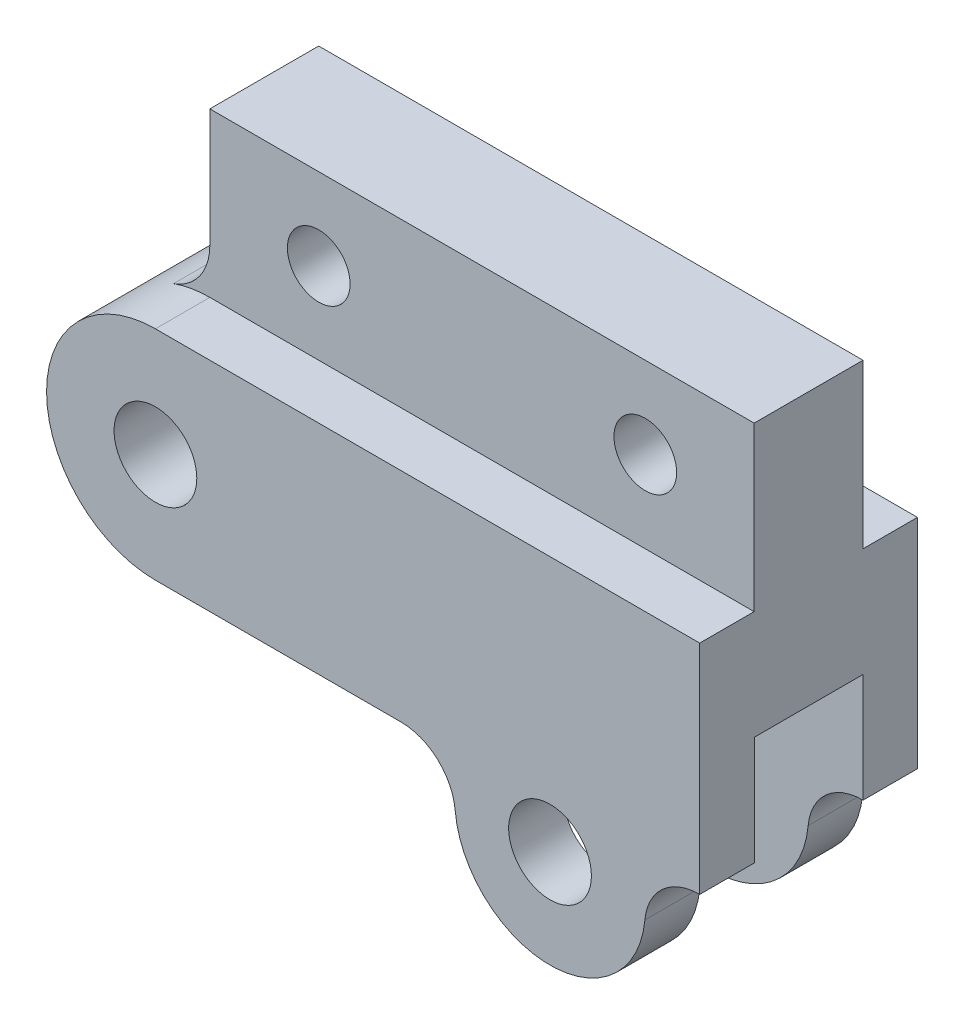
ISO-10303-21;
HEADER;
FILE_DESCRIPTION(('STEP AP214'),'2;1');
FILE_NAME('part.step','',(''),(''),'','','');
FILE_SCHEMA(('AUTOMOTIVE_DESIGN { 1 0 10303 214 1 1 1 1 }'));
ENDSEC;
DATA;
#1=APPLICATION_CONTEXT('core data for automotive mechanical design processes');
#2=APPLICATION_PROTOCOL_DEFINITION('international standard','automotive_design',2000,#1);
#3=PRODUCT_CONTEXT('',#1,'mechanical');
#4=PRODUCT('Part','Part','',(#3));
#5=PRODUCT_RELATED_PRODUCT_CATEGORY('part','',(#4));
#6=PRODUCT_DEFINITION_FORMATION('','',#4);
#7=PRODUCT_DEFINITION_CONTEXT('part definition',#1,'design');
#8=PRODUCT_DEFINITION('design','',#6,#7);
#9=PRODUCT_DEFINITION_SHAPE('','',#8);
#10=(LENGTH_UNIT() NAMED_UNIT(*) SI_UNIT(.MILLI.,.METRE.));
#11=(NAMED_UNIT(*) PLANE_ANGLE_UNIT() SI_UNIT($,.RADIAN.));
#12=(NAMED_UNIT(*) SI_UNIT($,.STERADIAN.) SOLID_ANGLE_UNIT());
#13=UNCERTAINTY_MEASURE_WITH_UNIT(LENGTH_MEASURE(1.E-05),#10,'distance_accuracy_value','');
#14=(GEOMETRIC_REPRESENTATION_CONTEXT(3) GLOBAL_UNCERTAINTY_ASSIGNED_CONTEXT((#13)) GLOBAL_UNIT_ASSIGNED_CONTEXT((#10,
#11,#12)) REPRESENTATION_CONTEXT('',''));
#15=CARTESIAN_POINT('',(0.,0.,0.));
#16=DIRECTION('',(0.,0.,1.));
#17=DIRECTION('',(1.,0.,0.));
#18=AXIS2_PLACEMENT_3D('',#15,#16,#17);
#19=CARTESIAN_POINT('',(-12.7,0.,-6.35));
#20=DIRECTION('',(0.,0.,-1.));
#21=DIRECTION('',(-1.,0.,0.));
#22=AXIS2_PLACEMENT_3D('',#19,#20,#21);
#23=CYLINDRICAL_SURFACE('',#22,6.35);
#24=DIRECTION('',(0.,0.,-1.));
#25=VECTOR('',#24,1.);
#26=CARTESIAN_POINT('',(-14.8166666666667,5.9868374140461,-6.35));
#27=LINE('',#26,#25);
#28=CARTESIAN_POINT('',(-14.8166666666667,5.9868374140461,3.175));
#29=VERTEX_POINT('',#28);
#30=CARTESIAN_POINT('',(-14.8166666666667,5.9868374140461,-3.175));
#31=VERTEX_POINT('',#30);
#32=EDGE_CURVE('E351',#29,#31,#27,.T.);
#33=ORIENTED_EDGE('',*,*,#32,.T.);
#34=CARTESIAN_POINT('',(-12.7,0.,-3.175));
#35=DIRECTION('',(0.,0.,1.));
#36=DIRECTION('',(1.,0.,0.));
#37=AXIS2_PLACEMENT_3D('',#34,#35,#36);
#38=CIRCLE('',#37,6.35);
#39=CARTESIAN_POINT('',(-12.7,6.35,-3.175));
#40=VERTEX_POINT('',#39);
#41=EDGE_CURVE('E354',#31,#40,#38,.F.);
#42=ORIENTED_EDGE('',*,*,#41,.T.);
#43=DIRECTION('',(0.,0.,-1.));
#44=VECTOR('',#43,1.);
#45=CARTESIAN_POINT('',(-12.7,6.35,6.35));
#46=LINE('',#45,#44);
#47=CARTESIAN_POINT('',(-12.7,6.35,-6.35));
#48=VERTEX_POINT('',#47);
#49=EDGE_CURVE('E340',#48,#40,#46,.F.);
#50=ORIENTED_EDGE('',*,*,#49,.F.);
#51=CARTESIAN_POINT('',(-12.7,0.,-6.35));
#52=DIRECTION('',(0.,0.,1.));
#53=DIRECTION('',(1.,0.,0.));
#54=AXIS2_PLACEMENT_3D('',#51,#52,#53);
#55=CIRCLE('',#54,6.35);
#56=CARTESIAN_POINT('',(-12.7,-6.35,-6.35));
#57=VERTEX_POINT('',#56);
#58=EDGE_CURVE('E346',#57,#48,#55,.F.);
#59=ORIENTED_EDGE('',*,*,#58,.F.);
#60=DIRECTION('',(0.,0.,1.));
#61=VECTOR('',#60,1.);
#62=CARTESIAN_POINT('',(-12.7,-6.35,-6.35));
#63=LINE('',#62,#61);
#64=CARTESIAN_POINT('',(-12.7,-6.35,6.35));
#65=VERTEX_POINT('',#64);
#66=EDGE_CURVE('E343',#65,#57,#63,.F.);
#67=ORIENTED_EDGE('',*,*,#66,.F.);
#68=CARTESIAN_POINT('',(-12.7,0.,6.35));
#69=DIRECTION('',(0.,0.,1.));
#70=DIRECTION('',(1.,0.,0.));
#71=AXIS2_PLACEMENT_3D('',#68,#69,#70);
#72=CIRCLE('',#71,6.35);
#73=CARTESIAN_POINT('',(-12.7,6.35,6.35));
#74=VERTEX_POINT('',#73);
#75=EDGE_CURVE('E348',#74,#65,#72,.T.);
#76=ORIENTED_EDGE('',*,*,#75,.F.);
#77=DIRECTION('',(0.,0.,-1.));
#78=VECTOR('',#77,1.);
#79=CARTESIAN_POINT('',(-12.7,6.35,6.35));
#80=LINE('',#79,#78);
#81=CARTESIAN_POINT('',(-12.7,6.35,3.175));
#82=VERTEX_POINT('',#81);
#83=EDGE_CURVE('E337',#82,#74,#80,.F.);
#84=ORIENTED_EDGE('',*,*,#83,.F.);
#85=CARTESIAN_POINT('',(-12.7,0.,3.175));
#86=DIRECTION('',(0.,0.,1.));
#87=DIRECTION('',(1.,0.,0.));
#88=AXIS2_PLACEMENT_3D('',#85,#86,#87);
#89=CIRCLE('',#88,6.35);
#90=EDGE_CURVE('E50',#82,#29,#89,.T.);
#91=ORIENTED_EDGE('',*,*,#90,.T.);
#92=EDGE_LOOP('',(#33,#42,#50,#59,#67,#76,#84,#91));
#93=FACE_BOUND('',#92,.T.);
#94=ADVANCED_FACE('F36',(#93),#23,.T.);
#95=CARTESIAN_POINT('',(0.,6.35,6.35));
#96=DIRECTION('',(0.,-1.,0.));
#97=DIRECTION('',(0.,0.,-1.));
#98=AXIS2_PLACEMENT_3D('',#95,#96,#97);
#99=PLANE('',#98);
#100=DIRECTION('',(-1.,0.,0.));
#101=VECTOR('',#100,1.);
#102=CARTESIAN_POINT('',(0.,6.35,-6.35));
#103=LINE('',#102,#101);
#104=CARTESIAN_POINT('',(19.05,6.35,-6.35));
#105=VERTEX_POINT('',#104);
#106=EDGE_CURVE('E408',#105,#48,#103,.T.);
#107=ORIENTED_EDGE('',*,*,#106,.T.);
#108=ORIENTED_EDGE('',*,*,#49,.T.);
#109=DIRECTION('',(1.,0.,0.));
#110=VECTOR('',#109,1.);
#111=CARTESIAN_POINT('',(19.05,6.35,-3.175));
#112=LINE('',#111,#110);
#113=CARTESIAN_POINT('',(19.05,6.35,-3.175));
#114=VERTEX_POINT('',#113);
#115=EDGE_CURVE('E265',#40,#114,#112,.T.);
#116=ORIENTED_EDGE('',*,*,#115,.T.);
#117=DIRECTION('',(0.,0.,-1.));
#118=VECTOR('',#117,1.);
#119=CARTESIAN_POINT('',(19.05,6.35,6.35));
#120=LINE('',#119,#118);
#121=EDGE_CURVE('E384',#114,#105,#120,.T.);
#122=ORIENTED_EDGE('',*,*,#121,.T.);
#123=EDGE_LOOP('',(#107,#108,#116,#122));
#124=FACE_BOUND('',#123,.T.);
#125=ADVANCED_FACE('F450',(#124),#99,.F.);
#126=CARTESIAN_POINT('',(10.31875,-8.73125,-6.35));
#127=DIRECTION('',(0.,0.,-1.));
#128=DIRECTION('',(-1.,0.,0.));
#129=AXIS2_PLACEMENT_3D('',#126,#127,#128);
#130=CYLINDRICAL_SURFACE('',#129,5.55625);
#131=CARTESIAN_POINT('',(10.31875,-8.73125,-3.175));
#132=DIRECTION('',(0.,0.,1.));
#133=DIRECTION('',(1.,0.,0.));
#134=AXIS2_PLACEMENT_3D('',#131,#132,#133);
#135=CIRCLE('',#134,5.55625);
#136=CARTESIAN_POINT('',(4.7855073452035,-9.23636363636363,-3.175));
#137=VERTEX_POINT('',#136);
#138=CARTESIAN_POINT('',(15.8519926547965,-9.23636363636363,-3.175));
#139=VERTEX_POINT('',#138);
#140=EDGE_CURVE('E298',#137,#139,#135,.T.);
#141=ORIENTED_EDGE('',*,*,#140,.F.);
#142=DIRECTION('',(0.,0.,-1.));
#143=VECTOR('',#142,1.);
#144=CARTESIAN_POINT('',(4.7855073452035,-9.23636363636363,-6.35));
#145=LINE('',#144,#143);
#146=CARTESIAN_POINT('',(4.7855073452035,-9.23636363636363,-6.35));
#147=VERTEX_POINT('',#146);
#148=EDGE_CURVE('E312',#137,#147,#145,.T.);
#149=ORIENTED_EDGE('',*,*,#148,.T.);
#150=CARTESIAN_POINT('',(10.31875,-8.73125,-6.35));
#151=DIRECTION('',(0.,0.,1.));
#152=DIRECTION('',(1.,0.,0.));
#153=AXIS2_PLACEMENT_3D('',#150,#151,#152);
#154=CIRCLE('',#153,5.55625);
#155=CARTESIAN_POINT('',(15.8519926547965,-9.23636363636363,-6.35));
#156=VERTEX_POINT('',#155);
#157=EDGE_CURVE('E295',#156,#147,#154,.F.);
#158=ORIENTED_EDGE('',*,*,#157,.F.);
#159=DIRECTION('',(0.,0.,-1.));
#160=VECTOR('',#159,1.);
#161=CARTESIAN_POINT('',(15.8519926547965,-9.23636363636363,-6.35));
#162=LINE('',#161,#160);
#163=EDGE_CURVE('E310',#156,#139,#162,.F.);
#164=ORIENTED_EDGE('',*,*,#163,.T.);
#165=EDGE_LOOP('',(#141,#149,#158,#164));
#166=FACE_BOUND('',#165,.T.);
#167=ADVANCED_FACE('F462',(#166),#130,.T.);
#168=CARTESIAN_POINT('',(10.31875,-8.73125,3.1496));
#169=DIRECTION('',(0.,0.,-1.));
#170=DIRECTION('',(-1.,0.,0.));
#171=AXIS2_PLACEMENT_3D('',#168,#169,#170);
#172=CYLINDRICAL_SURFACE('',#171,5.55625);
#173=CARTESIAN_POINT('',(10.31875,-8.73125,6.35));
#174=DIRECTION('',(0.,0.,1.));
#175=DIRECTION('',(1.,0.,0.));
#176=AXIS2_PLACEMENT_3D('',#173,#174,#175);
#177=CIRCLE('',#176,5.55625);
#178=CARTESIAN_POINT('',(4.7855073452035,-9.23636363636363,6.35));
#179=VERTEX_POINT('',#178);
#180=CARTESIAN_POINT('',(15.8519926547965,-9.23636363636363,6.35));
#181=VERTEX_POINT('',#180);
#182=EDGE_CURVE('E292',#179,#181,#177,.T.);
#183=ORIENTED_EDGE('',*,*,#182,.F.);
#184=DIRECTION('',(0.,0.,-1.));
#185=VECTOR('',#184,1.);
#186=CARTESIAN_POINT('',(4.7855073452035,-9.23636363636363,3.1496));
#187=LINE('',#186,#185);
#188=CARTESIAN_POINT('',(4.7855073452035,-9.23636363636363,3.1496));
#189=VERTEX_POINT('',#188);
#190=EDGE_CURVE('E303',#179,#189,#187,.T.);
#191=ORIENTED_EDGE('',*,*,#190,.T.);
#192=CARTESIAN_POINT('',(10.31875,-8.73125,3.1496));
#193=DIRECTION('',(0.,0.,1.));
#194=DIRECTION('',(1.,0.,0.));
#195=AXIS2_PLACEMENT_3D('',#192,#193,#194);
#196=CIRCLE('',#195,5.55625);
#197=CARTESIAN_POINT('',(15.8519926547965,-9.23636363636363,3.1496));
#198=VERTEX_POINT('',#197);
#199=EDGE_CURVE('E289',#198,#189,#196,.F.);
#200=ORIENTED_EDGE('',*,*,#199,.F.);
#201=DIRECTION('',(0.,0.,-1.));
#202=VECTOR('',#201,1.);
#203=CARTESIAN_POINT('',(15.8519926547965,-9.23636363636363,3.1496));
#204=LINE('',#203,#202);
#205=EDGE_CURVE('E301',#198,#181,#204,.F.);
#206=ORIENTED_EDGE('',*,*,#205,.T.);
#207=EDGE_LOOP('',(#183,#191,#200,#206));
#208=FACE_BOUND('',#207,.T.);
#209=ADVANCED_FACE('F432',(#208),#172,.T.);
#210=CARTESIAN_POINT('',(0.,-6.35,6.35));
#211=DIRECTION('',(0.,-1.,0.));
#212=DIRECTION('',(0.,0.,-1.));
#213=AXIS2_PLACEMENT_3D('',#210,#211,#212);
#214=PLANE('',#213);
#215=DIRECTION('',(-1.,0.,0.));
#216=VECTOR('',#215,1.);
#217=CARTESIAN_POINT('',(0.,-6.35,-3.175));
#218=LINE('',#217,#216);
#219=CARTESIAN_POINT('',(19.05,-6.35,-3.175));
#220=VERTEX_POINT('',#219);
#221=CARTESIAN_POINT('',(19.0138456003945,-6.35,-3.175));
#222=VERTEX_POINT('',#221);
#223=EDGE_CURVE('E229',#220,#222,#218,.T.);
#224=ORIENTED_EDGE('',*,*,#223,.T.);
#225=DIRECTION('',(0.,0.,1.));
#226=VECTOR('',#225,1.);
#227=CARTESIAN_POINT('',(19.0138456003945,-6.35,-6.35));
#228=LINE('',#227,#226);
#229=CARTESIAN_POINT('',(19.0138456003945,-6.35,-6.35));
#230=VERTEX_POINT('',#229);
#231=EDGE_CURVE('E318',#222,#230,#228,.F.);
#232=ORIENTED_EDGE('',*,*,#231,.T.);
#233=DIRECTION('',(-1.,0.,0.));
#234=VECTOR('',#233,1.);
#235=CARTESIAN_POINT('',(0.,-6.35,-6.35));
#236=LINE('',#235,#234);
#237=CARTESIAN_POINT('',(19.05,-6.35,-6.35));
#238=VERTEX_POINT('',#237);
#239=EDGE_CURVE('E392',#238,#230,#236,.T.);
#240=ORIENTED_EDGE('',*,*,#239,.F.);
#241=DIRECTION('',(0.,0.,-1.));
#242=VECTOR('',#241,1.);
#243=CARTESIAN_POINT('',(19.05,-6.35,6.35));
#244=LINE('',#243,#242);
#245=EDGE_CURVE('E413',#220,#238,#244,.T.);
#246=ORIENTED_EDGE('',*,*,#245,.F.);
#247=EDGE_LOOP('',(#224,#232,#240,#246));
#248=FACE_BOUND('',#247,.T.);
#249=ADVANCED_FACE('F444',(#248),#214,.T.);
#250=CARTESIAN_POINT('',(19.05,0.,6.35));
#251=DIRECTION('',(-1.,0.,0.));
#252=DIRECTION('',(0.,0.,1.));
#253=AXIS2_PLACEMENT_3D('',#250,#251,#252);
#254=PLANE('',#253);
#255=DIRECTION('',(0.,-1.,0.));
#256=VECTOR('',#255,1.);
#257=CARTESIAN_POINT('',(19.05,-14.2875,-3.175));
#258=LINE('',#257,#256);
#259=CARTESIAN_POINT('',(19.05,0.,-3.175));
#260=VERTEX_POINT('',#259);
#261=EDGE_CURVE('E215',#260,#220,#258,.T.);
#262=ORIENTED_EDGE('',*,*,#261,.T.);
#263=ORIENTED_EDGE('',*,*,#245,.T.);
#264=DIRECTION('',(0.,1.,0.));
#265=VECTOR('',#264,1.);
#266=CARTESIAN_POINT('',(19.05,0.,-6.35));
#267=LINE('',#266,#265);
#268=EDGE_CURVE('E394',#238,#105,#267,.T.);
#269=ORIENTED_EDGE('',*,*,#268,.T.);
#270=ORIENTED_EDGE('',*,*,#121,.F.);
#271=DIRECTION('',(0.,1.,0.));
#272=VECTOR('',#271,1.);
#273=CARTESIAN_POINT('',(19.05,6.35,-3.175));
#274=LINE('',#273,#272);
#275=CARTESIAN_POINT('',(19.05,15.875,-3.175));
#276=VERTEX_POINT('',#275);
#277=EDGE_CURVE('E254',#114,#276,#274,.T.);
#278=ORIENTED_EDGE('',*,*,#277,.T.);
#279=DIRECTION('',(0.,0.,-1.));
#280=VECTOR('',#279,1.);
#281=CARTESIAN_POINT('',(19.05,15.875,3.175));
#282=LINE('',#281,#280);
#283=CARTESIAN_POINT('',(19.05,15.875,3.175));
#284=VERTEX_POINT('',#283);
#285=EDGE_CURVE('E381',#284,#276,#282,.T.);
#286=ORIENTED_EDGE('',*,*,#285,.F.);
#287=DIRECTION('',(0.,1.,0.));
#288=VECTOR('',#287,1.);
#289=CARTESIAN_POINT('',(19.05,6.35,3.175));
#290=LINE('',#289,#288);
#291=CARTESIAN_POINT('',(19.05,6.35,3.175));
#292=VERTEX_POINT('',#291);
#293=EDGE_CURVE('E258',#292,#284,#290,.T.);
#294=ORIENTED_EDGE('',*,*,#293,.F.);
#295=CARTESIAN_POINT('',(19.05,6.35,6.35));
#296=VERTEX_POINT('',#295);
#297=EDGE_CURVE('E378',#296,#292,#120,.T.);
#298=ORIENTED_EDGE('',*,*,#297,.F.);
#299=DIRECTION('',(0.,1.,0.));
#300=VECTOR('',#299,1.);
#301=CARTESIAN_POINT('',(19.05,0.,6.35));
#302=LINE('',#301,#300);
#303=CARTESIAN_POINT('',(19.05,-6.35,6.35));
#304=VERTEX_POINT('',#303);
#305=EDGE_CURVE('E401',#304,#296,#302,.T.);
#306=ORIENTED_EDGE('',*,*,#305,.F.);
#307=CARTESIAN_POINT('',(19.05,-6.35,3.1496));
#308=VERTEX_POINT('',#307);
#309=EDGE_CURVE('E211',#304,#308,#244,.T.);
#310=ORIENTED_EDGE('',*,*,#309,.T.);
#311=DIRECTION('',(0.,1.,0.));
#312=VECTOR('',#311,1.);
#313=CARTESIAN_POINT('',(19.05,-14.2875,3.1496));
#314=LINE('',#313,#312);
#315=CARTESIAN_POINT('',(19.05,0.,3.14960000000001));
#316=VERTEX_POINT('',#315);
#317=EDGE_CURVE('E198',#308,#316,#314,.T.);
#318=ORIENTED_EDGE('',*,*,#317,.T.);
#319=DIRECTION('',(0.,0.,1.));
#320=VECTOR('',#319,1.);
#321=CARTESIAN_POINT('',(19.05,0.,-28.9126142656386));
#322=LINE('',#321,#320);
#323=EDGE_CURVE('E186',#260,#316,#322,.T.);
#324=ORIENTED_EDGE('',*,*,#323,.F.);
#325=EDGE_LOOP('',(#262,#263,#269,#270,#278,#286,#294,#298,#306,#310,#318,#324));
#326=FACE_BOUND('',#325,.T.);
#327=ADVANCED_FACE('F209',(#326),#254,.F.);
#328=DIRECTION('',(-1.,0.,0.));
#329=VECTOR('',#328,1.);
#330=CARTESIAN_POINT('',(0.,-6.35,6.35));
#331=LINE('',#330,#329);
#332=CARTESIAN_POINT('',(1.62365439960549,-6.35,6.35));
#333=VERTEX_POINT('',#332);
#334=EDGE_CURVE('E402',#333,#65,#331,.T.);
#335=ORIENTED_EDGE('',*,*,#334,.T.);
#336=ORIENTED_EDGE('',*,*,#66,.T.);
#337=CARTESIAN_POINT('',(1.62365439960549,-6.35,-6.35));
#338=VERTEX_POINT('',#337);
#339=EDGE_CURVE('E396',#338,#57,#236,.T.);
#340=ORIENTED_EDGE('',*,*,#339,.F.);
#341=DIRECTION('',(0.,0.,1.));
#342=VECTOR('',#341,1.);
#343=CARTESIAN_POINT('',(1.62365439960549,-6.35,-3.175));
#344=LINE('',#343,#342);
#345=CARTESIAN_POINT('',(1.62365439960549,-6.35,-3.175));
#346=VERTEX_POINT('',#345);
#347=EDGE_CURVE('E306',#338,#346,#344,.T.);
#348=ORIENTED_EDGE('',*,*,#347,.T.);
#349=DIRECTION('',(-1.,0.,0.));
#350=VECTOR('',#349,1.);
#351=CARTESIAN_POINT('',(0.,-6.35,-3.175));
#352=LINE('',#351,#350);
#353=CARTESIAN_POINT('',(1.5875,-6.35,-3.175));
#354=VERTEX_POINT('',#353);
#355=EDGE_CURVE('E227',#346,#354,#352,.T.);
#356=ORIENTED_EDGE('',*,*,#355,.T.);
#357=DIRECTION('',(0.,0.,-1.));
#358=VECTOR('',#357,1.);
#359=CARTESIAN_POINT('',(1.5875,-6.35,6.35));
#360=LINE('',#359,#358);
#361=CARTESIAN_POINT('',(1.5875,-6.35,3.1496));
#362=VERTEX_POINT('',#361);
#363=EDGE_CURVE('E286',#362,#354,#360,.T.);
#364=ORIENTED_EDGE('',*,*,#363,.F.);
#365=DIRECTION('',(-1.,0.,0.));
#366=VECTOR('',#365,1.);
#367=CARTESIAN_POINT('',(0.,-6.35,3.1496));
#368=LINE('',#367,#366);
#369=CARTESIAN_POINT('',(1.62365439960549,-6.35,3.1496));
#370=VERTEX_POINT('',#369);
#371=EDGE_CURVE('E222',#370,#362,#368,.T.);
#372=ORIENTED_EDGE('',*,*,#371,.F.);
#373=DIRECTION('',(0.,0.,1.));
#374=VECTOR('',#373,1.);
#375=CARTESIAN_POINT('',(1.62365439960549,-6.35,6.35));
#376=LINE('',#375,#374);
#377=EDGE_CURVE('E308',#370,#333,#376,.T.);
#378=ORIENTED_EDGE('',*,*,#377,.T.);
#379=EDGE_LOOP('',(#335,#336,#340,#348,#356,#364,#372,#378));
#380=FACE_BOUND('',#379,.T.);
#381=ADVANCED_FACE('F418',(#380),#214,.T.);
#382=CARTESIAN_POINT('',(10.31875,-8.5725,6.35));
#383=DIRECTION('',(0.,0.,1.));
#384=DIRECTION('',(1.,0.,0.));
#385=AXIS2_PLACEMENT_3D('',#382,#383,#384);
#386=CYLINDRICAL_SURFACE('',#385,2.413);
#387=CARTESIAN_POINT('',(10.31875,-8.5725,-6.35));
#388=DIRECTION('',(0.,0.,1.));
#389=DIRECTION('',(1.,0.,0.));
#390=AXIS2_PLACEMENT_3D('',#387,#388,#389);
#391=CIRCLE('',#390,2.413);
#392=CARTESIAN_POINT('',(12.73175,-8.5725,-6.35));
#393=VERTEX_POINT('',#392);
#394=EDGE_CURVE('E239',#393,#393,#391,.T.);
#395=ORIENTED_EDGE('',*,*,#394,.F.);
#396=EDGE_LOOP('',(#395));
#397=FACE_BOUND('',#396,.T.);
#398=CARTESIAN_POINT('',(10.31875,-8.5725,-3.175));
#399=DIRECTION('',(0.,0.,1.));
#400=DIRECTION('',(1.,0.,0.));
#401=AXIS2_PLACEMENT_3D('',#398,#399,#400);
#402=CIRCLE('',#401,2.413);
#403=CARTESIAN_POINT('',(12.73175,-8.5725,-3.175));
#404=VERTEX_POINT('',#403);
#405=EDGE_CURVE('E226',#404,#404,#402,.F.);
#406=ORIENTED_EDGE('',*,*,#405,.F.);
#407=EDGE_LOOP('',(#406));
#408=FACE_BOUND('',#407,.T.);
#409=ADVANCED_FACE('F442',(#397,#408),#386,.F.);
#410=CARTESIAN_POINT('',(19.0138456003945,-6.35,6.35));
#411=VERTEX_POINT('',#410);
#412=EDGE_CURVE('E398',#304,#411,#331,.T.);
#413=ORIENTED_EDGE('',*,*,#412,.T.);
#414=DIRECTION('',(0.,0.,1.));
#415=VECTOR('',#414,1.);
#416=CARTESIAN_POINT('',(19.0138456003945,-6.35,3.1496));
#417=LINE('',#416,#415);
#418=CARTESIAN_POINT('',(19.0138456003945,-6.35,3.1496));
#419=VERTEX_POINT('',#418);
#420=EDGE_CURVE('E315',#411,#419,#417,.F.);
#421=ORIENTED_EDGE('',*,*,#420,.T.);
#422=DIRECTION('',(-1.,0.,0.));
#423=VECTOR('',#422,1.);
#424=CARTESIAN_POINT('',(0.,-6.35,3.1496));
#425=LINE('',#424,#423);
#426=EDGE_CURVE('E224',#308,#419,#425,.T.);
#427=ORIENTED_EDGE('',*,*,#426,.F.);
#428=ORIENTED_EDGE('',*,*,#309,.F.);
#429=EDGE_LOOP('',(#413,#421,#427,#428));
#430=FACE_BOUND('',#429,.T.);
#431=ADVANCED_FACE('F439',(#430),#214,.T.);
#432=DIRECTION('',(1.,0.,0.));
#433=VECTOR('',#432,1.);
#434=CARTESIAN_POINT('',(19.05,6.35,3.175));
#435=LINE('',#434,#433);
#436=EDGE_CURVE('E260',#82,#292,#435,.T.);
#437=ORIENTED_EDGE('',*,*,#436,.F.);
#438=ORIENTED_EDGE('',*,*,#83,.T.);
#439=DIRECTION('',(-1.,0.,0.));
#440=VECTOR('',#439,1.);
#441=CARTESIAN_POINT('',(0.,6.35,6.35));
#442=LINE('',#441,#440);
#443=EDGE_CURVE('E404',#296,#74,#442,.T.);
#444=ORIENTED_EDGE('',*,*,#443,.F.);
#445=ORIENTED_EDGE('',*,*,#297,.T.);
#446=EDGE_LOOP('',(#437,#438,#444,#445));
#447=FACE_BOUND('',#446,.T.);
#448=ADVANCED_FACE('F376',(#447),#99,.F.);
#449=CARTESIAN_POINT('',(0.,0.,6.35));
#450=DIRECTION('',(0.,0.,1.));
#451=DIRECTION('',(1.,0.,0.));
#452=AXIS2_PLACEMENT_3D('',#449,#450,#451);
#453=PLANE('',#452);
#454=CARTESIAN_POINT('',(-12.7,0.,6.35));
#455=DIRECTION('',(0.,0.,1.));
#456=DIRECTION('',(1.,0.,0.));
#457=AXIS2_PLACEMENT_3D('',#454,#455,#456);
#458=CIRCLE('',#457,2.413);
#459=CARTESIAN_POINT('',(-10.287,0.,6.35));
#460=VERTEX_POINT('',#459);
#461=EDGE_CURVE('E232',#460,#460,#458,.T.);
#462=ORIENTED_EDGE('',*,*,#461,.F.);
#463=EDGE_LOOP('',(#462));
#464=FACE_BOUND('',#463,.T.);
#465=CARTESIAN_POINT('',(10.31875,-8.5725,6.35));
#466=DIRECTION('',(0.,0.,1.));
#467=DIRECTION('',(1.,0.,0.));
#468=AXIS2_PLACEMENT_3D('',#465,#466,#467);
#469=CIRCLE('',#468,2.413);
#470=CARTESIAN_POINT('',(12.73175,-8.5725,6.35));
#471=VERTEX_POINT('',#470);
#472=EDGE_CURVE('E236',#471,#471,#469,.T.);
#473=ORIENTED_EDGE('',*,*,#472,.F.);
#474=EDGE_LOOP('',(#473));
#475=FACE_BOUND('',#474,.T.);
#476=ORIENTED_EDGE('',*,*,#443,.T.);
#477=ORIENTED_EDGE('',*,*,#75,.T.);
#478=ORIENTED_EDGE('',*,*,#334,.F.);
#479=CARTESIAN_POINT('',(1.62365439960549,-9.525,6.35));
#480=DIRECTION('',(0.,0.,1.));
#481=DIRECTION('',(1.,0.,0.));
#482=AXIS2_PLACEMENT_3D('',#479,#480,#481);
#483=CIRCLE('',#482,3.175);
#484=EDGE_CURVE('E323',#333,#179,#483,.F.);
#485=ORIENTED_EDGE('',*,*,#484,.T.);
#486=ORIENTED_EDGE('',*,*,#182,.T.);
#487=CARTESIAN_POINT('',(19.0138456003945,-9.525,6.35));
#488=DIRECTION('',(0.,0.,1.));
#489=DIRECTION('',(1.,0.,0.));
#490=AXIS2_PLACEMENT_3D('',#487,#488,#489);
#491=CIRCLE('',#490,3.175);
#492=EDGE_CURVE('E331',#181,#411,#491,.F.);
#493=ORIENTED_EDGE('',*,*,#492,.T.);
#494=ORIENTED_EDGE('',*,*,#412,.F.);
#495=ORIENTED_EDGE('',*,*,#305,.T.);
#496=EDGE_LOOP('',(#476,#477,#478,#485,#486,#493,#494,#495));
#497=FACE_BOUND('',#496,.T.);
#498=ADVANCED_FACE('F425',(#464,#475,#497),#453,.T.);
#499=CARTESIAN_POINT('',(0.,0.,-6.35));
#500=DIRECTION('',(0.,0.,1.));
#501=DIRECTION('',(1.,0.,0.));
#502=AXIS2_PLACEMENT_3D('',#499,#500,#501);
#503=PLANE('',#502);
#504=CARTESIAN_POINT('',(-12.7,0.,-6.35));
#505=DIRECTION('',(0.,0.,1.));
#506=DIRECTION('',(1.,0.,0.));
#507=AXIS2_PLACEMENT_3D('',#504,#505,#506);
#508=CIRCLE('',#507,2.413);
#509=CARTESIAN_POINT('',(-10.287,0.,-6.35));
#510=VERTEX_POINT('',#509);
#511=EDGE_CURVE('E235',#510,#510,#508,.T.);
#512=ORIENTED_EDGE('',*,*,#511,.T.);
#513=EDGE_LOOP('',(#512));
#514=FACE_BOUND('',#513,.T.);
#515=ORIENTED_EDGE('',*,*,#394,.T.);
#516=EDGE_LOOP('',(#515));
#517=FACE_BOUND('',#516,.T.);
#518=ORIENTED_EDGE('',*,*,#339,.T.);
#519=ORIENTED_EDGE('',*,*,#58,.T.);
#520=ORIENTED_EDGE('',*,*,#106,.F.);
#521=ORIENTED_EDGE('',*,*,#268,.F.);
#522=ORIENTED_EDGE('',*,*,#239,.T.);
#523=CARTESIAN_POINT('',(19.0138456003945,-9.525,-6.35));
#524=DIRECTION('',(0.,0.,1.));
#525=DIRECTION('',(1.,0.,0.));
#526=AXIS2_PLACEMENT_3D('',#523,#524,#525);
#527=CIRCLE('',#526,3.175);
#528=EDGE_CURVE('E333',#230,#156,#527,.T.);
#529=ORIENTED_EDGE('',*,*,#528,.T.);
#530=ORIENTED_EDGE('',*,*,#157,.T.);
#531=CARTESIAN_POINT('',(1.62365439960549,-9.525,-6.35));
#532=DIRECTION('',(0.,0.,1.));
#533=DIRECTION('',(1.,0.,0.));
#534=AXIS2_PLACEMENT_3D('',#531,#532,#533);
#535=CIRCLE('',#534,3.175);
#536=EDGE_CURVE('E325',#147,#338,#535,.T.);
#537=ORIENTED_EDGE('',*,*,#536,.T.);
#538=EDGE_LOOP('',(#518,#519,#520,#521,#522,#529,#530,#537));
#539=FACE_BOUND('',#538,.T.);
#540=ADVANCED_FACE('F649',(#514,#517,#539),#503,.F.);
#541=CARTESIAN_POINT('',(19.05,15.875,3.175));
#542=DIRECTION('',(0.,-1.,0.));
#543=DIRECTION('',(1.,0.,0.));
#544=AXIS2_PLACEMENT_3D('',#541,#542,#543);
#545=PLANE('',#544);
#546=DIRECTION('',(-1.,0.,0.));
#547=VECTOR('',#546,1.);
#548=CARTESIAN_POINT('',(19.05,15.875,-3.175));
#549=LINE('',#548,#547);
#550=CARTESIAN_POINT('',(-12.7,15.875,-3.175));
#551=VERTEX_POINT('',#550);
#552=EDGE_CURVE('E261',#276,#551,#549,.T.);
#553=ORIENTED_EDGE('',*,*,#552,.T.);
#554=DIRECTION('',(0.,0.,-1.));
#555=VECTOR('',#554,1.);
#556=CARTESIAN_POINT('',(-12.7,15.875,3.175));
#557=LINE('',#556,#555);
#558=CARTESIAN_POINT('',(-12.7,15.875,3.175));
#559=VERTEX_POINT('',#558);
#560=EDGE_CURVE('E268',#559,#551,#557,.T.);
#561=ORIENTED_EDGE('',*,*,#560,.F.);
#562=DIRECTION('',(-1.,0.,0.));
#563=VECTOR('',#562,1.);
#564=CARTESIAN_POINT('',(19.05,15.875,3.175));
#565=LINE('',#564,#563);
#566=EDGE_CURVE('E255',#284,#559,#565,.T.);
#567=ORIENTED_EDGE('',*,*,#566,.F.);
#568=ORIENTED_EDGE('',*,*,#285,.T.);
#569=EDGE_LOOP('',(#553,#561,#567,#568));
#570=FACE_BOUND('',#569,.T.);
#571=ADVANCED_FACE('F639',(#570),#545,.F.);
#572=CARTESIAN_POINT('',(-12.7,6.35,3.175));
#573=DIRECTION('',(1.,0.,0.));
#574=DIRECTION('',(0.,0.,-1.));
#575=AXIS2_PLACEMENT_3D('',#572,#573,#574);
#576=PLANE('',#575);
#577=DIRECTION('',(0.,-1.,0.));
#578=VECTOR('',#577,1.);
#579=CARTESIAN_POINT('',(-12.7,6.35,-3.175));
#580=LINE('',#579,#578);
#581=CARTESIAN_POINT('',(-12.7,8.98025612106915,-3.175));
#582=VERTEX_POINT('',#581);
#583=EDGE_CURVE('E263',#551,#582,#580,.T.);
#584=ORIENTED_EDGE('',*,*,#583,.T.);
#585=DIRECTION('',(0.,0.,-1.));
#586=VECTOR('',#585,1.);
#587=CARTESIAN_POINT('',(-12.7,8.98025612106915,3.175));
#588=LINE('',#587,#586);
#589=CARTESIAN_POINT('',(-12.7,8.98025612106915,3.175));
#590=VERTEX_POINT('',#589);
#591=EDGE_CURVE('E58',#582,#590,#588,.F.);
#592=ORIENTED_EDGE('',*,*,#591,.T.);
#593=DIRECTION('',(0.,-1.,0.));
#594=VECTOR('',#593,1.);
#595=CARTESIAN_POINT('',(-12.7,6.35,3.175));
#596=LINE('',#595,#594);
#597=EDGE_CURVE('E257',#559,#590,#596,.T.);
#598=ORIENTED_EDGE('',*,*,#597,.F.);
#599=ORIENTED_EDGE('',*,*,#560,.T.);
#600=EDGE_LOOP('',(#584,#592,#598,#599));
#601=FACE_BOUND('',#600,.T.);
#602=ADVANCED_FACE('F364',(#601),#576,.F.);
#603=CARTESIAN_POINT('',(0.,0.,3.175));
#604=DIRECTION('',(0.,0.,1.));
#605=DIRECTION('',(1.,0.,0.));
#606=AXIS2_PLACEMENT_3D('',#603,#604,#605);
#607=PLANE('',#606);
#608=CARTESIAN_POINT('',(-6.35,11.1125,3.175));
#609=DIRECTION('',(0.,0.,1.));
#610=DIRECTION('',(1.,0.,0.));
#611=AXIS2_PLACEMENT_3D('',#608,#609,#610);
#612=CIRCLE('',#611,1.8288);
#613=CARTESIAN_POINT('',(-4.5212,11.1125,3.175));
#614=VERTEX_POINT('',#613);
#615=EDGE_CURVE('E242',#614,#614,#612,.T.);
#616=ORIENTED_EDGE('',*,*,#615,.F.);
#617=EDGE_LOOP('',(#616));
#618=FACE_BOUND('',#617,.T.);
#619=CARTESIAN_POINT('',(12.7,11.1125,3.175));
#620=DIRECTION('',(0.,0.,1.));
#621=DIRECTION('',(1.,0.,0.));
#622=AXIS2_PLACEMENT_3D('',#619,#620,#621);
#623=CIRCLE('',#622,1.8288);
#624=CARTESIAN_POINT('',(14.5288,11.1125,3.175));
#625=VERTEX_POINT('',#624);
#626=EDGE_CURVE('E248',#625,#625,#623,.T.);
#627=ORIENTED_EDGE('',*,*,#626,.F.);
#628=EDGE_LOOP('',(#627));
#629=FACE_BOUND('',#628,.T.);
#630=ORIENTED_EDGE('',*,*,#293,.T.);
#631=ORIENTED_EDGE('',*,*,#566,.T.);
#632=ORIENTED_EDGE('',*,*,#597,.T.);
#633=CARTESIAN_POINT('',(-15.875,8.98025612106915,3.175));
#634=DIRECTION('',(0.,0.,1.));
#635=DIRECTION('',(1.,0.,0.));
#636=AXIS2_PLACEMENT_3D('',#633,#634,#635);
#637=CIRCLE('',#636,3.175);
#638=EDGE_CURVE('E12',#590,#29,#637,.F.);
#639=ORIENTED_EDGE('',*,*,#638,.T.);
#640=ORIENTED_EDGE('',*,*,#90,.F.);
#641=ORIENTED_EDGE('',*,*,#436,.T.);
#642=EDGE_LOOP('',(#630,#631,#632,#639,#640,#641));
#643=FACE_BOUND('',#642,.T.);
#644=ADVANCED_FACE('F368',(#618,#629,#643),#607,.T.);
#645=CARTESIAN_POINT('',(0.,0.,-3.175));
#646=DIRECTION('',(0.,0.,1.));
#647=DIRECTION('',(1.,0.,0.));
#648=AXIS2_PLACEMENT_3D('',#645,#646,#647);
#649=PLANE('',#648);
#650=CARTESIAN_POINT('',(-6.35,11.1125,-3.175));
#651=DIRECTION('',(0.,0.,1.));
#652=DIRECTION('',(1.,0.,0.));
#653=AXIS2_PLACEMENT_3D('',#650,#651,#652);
#654=CIRCLE('',#653,1.8288);
#655=CARTESIAN_POINT('',(-4.5212,11.1125,-3.175));
#656=VERTEX_POINT('',#655);
#657=EDGE_CURVE('E245',#656,#656,#654,.T.);
#658=ORIENTED_EDGE('',*,*,#657,.T.);
#659=EDGE_LOOP('',(#658));
#660=FACE_BOUND('',#659,.T.);
#661=CARTESIAN_POINT('',(12.7,11.1125,-3.175));
#662=DIRECTION('',(0.,0.,1.));
#663=DIRECTION('',(1.,0.,0.));
#664=AXIS2_PLACEMENT_3D('',#661,#662,#663);
#665=CIRCLE('',#664,1.8288);
#666=CARTESIAN_POINT('',(14.5288,11.1125,-3.175));
#667=VERTEX_POINT('',#666);
#668=EDGE_CURVE('E251',#667,#667,#665,.T.);
#669=ORIENTED_EDGE('',*,*,#668,.T.);
#670=EDGE_LOOP('',(#669));
#671=FACE_BOUND('',#670,.T.);
#672=ORIENTED_EDGE('',*,*,#277,.F.);
#673=ORIENTED_EDGE('',*,*,#115,.F.);
#674=ORIENTED_EDGE('',*,*,#41,.F.);
#675=CARTESIAN_POINT('',(-15.875,8.98025612106915,-3.175));
#676=DIRECTION('',(0.,0.,1.));
#677=DIRECTION('',(1.,0.,0.));
#678=AXIS2_PLACEMENT_3D('',#675,#676,#677);
#679=CIRCLE('',#678,3.175);
#680=EDGE_CURVE('E44',#31,#582,#679,.T.);
#681=ORIENTED_EDGE('',*,*,#680,.T.);
#682=ORIENTED_EDGE('',*,*,#583,.F.);
#683=ORIENTED_EDGE('',*,*,#552,.F.);
#684=EDGE_LOOP('',(#672,#673,#674,#681,#682,#683));
#685=FACE_BOUND('',#684,.T.);
#686=ADVANCED_FACE('F359',(#660,#671,#685),#649,.F.);
#687=CARTESIAN_POINT('',(12.7,11.1125,3.175));
#688=DIRECTION('',(0.,0.,1.));
#689=DIRECTION('',(1.,0.,0.));
#690=AXIS2_PLACEMENT_3D('',#687,#688,#689);
#691=CYLINDRICAL_SURFACE('',#690,1.8288);
#692=ORIENTED_EDGE('',*,*,#626,.T.);
#693=EDGE_LOOP('',(#692));
#694=FACE_BOUND('',#693,.T.);
#695=ORIENTED_EDGE('',*,*,#668,.F.);
#696=EDGE_LOOP('',(#695));
#697=FACE_BOUND('',#696,.T.);
#698=ADVANCED_FACE('F620',(#694,#697),#691,.F.);
#699=CARTESIAN_POINT('',(-6.35,11.1125,3.175));
#700=DIRECTION('',(0.,0.,1.));
#701=DIRECTION('',(1.,0.,0.));
#702=AXIS2_PLACEMENT_3D('',#699,#700,#701);
#703=CYLINDRICAL_SURFACE('',#702,1.8288);
#704=ORIENTED_EDGE('',*,*,#615,.T.);
#705=EDGE_LOOP('',(#704));
#706=FACE_BOUND('',#705,.T.);
#707=ORIENTED_EDGE('',*,*,#657,.F.);
#708=EDGE_LOOP('',(#707));
#709=FACE_BOUND('',#708,.T.);
#710=ADVANCED_FACE('F508',(#706,#709),#703,.F.);
#711=CARTESIAN_POINT('',(10.31875,-8.5725,3.1496));
#712=DIRECTION('',(0.,0.,1.));
#713=DIRECTION('',(1.,0.,0.));
#714=AXIS2_PLACEMENT_3D('',#711,#712,#713);
#715=CIRCLE('',#714,2.413);
#716=CARTESIAN_POINT('',(12.73175,-8.5725,3.1496));
#717=VERTEX_POINT('',#716);
#718=EDGE_CURVE('E220',#717,#717,#715,.F.);
#719=ORIENTED_EDGE('',*,*,#718,.T.);
#720=EDGE_LOOP('',(#719));
#721=FACE_BOUND('',#720,.T.);
#722=ORIENTED_EDGE('',*,*,#472,.T.);
#723=EDGE_LOOP('',(#722));
#724=FACE_BOUND('',#723,.T.);
#725=ADVANCED_FACE('F453',(#721,#724),#386,.F.);
#726=CARTESIAN_POINT('',(-12.7,0.,6.35));
#727=DIRECTION('',(0.,0.,1.));
#728=DIRECTION('',(1.,0.,0.));
#729=AXIS2_PLACEMENT_3D('',#726,#727,#728);
#730=CYLINDRICAL_SURFACE('',#729,2.413);
#731=ORIENTED_EDGE('',*,*,#461,.T.);
#732=EDGE_LOOP('',(#731));
#733=FACE_BOUND('',#732,.T.);
#734=ORIENTED_EDGE('',*,*,#511,.F.);
#735=EDGE_LOOP('',(#734));
#736=FACE_BOUND('',#735,.T.);
#737=ADVANCED_FACE('F507',(#733,#736),#730,.F.);
#738=CARTESIAN_POINT('',(0.,0.,-3.175));
#739=DIRECTION('',(0.,0.,1.));
#740=DIRECTION('',(1.,0.,0.));
#741=AXIS2_PLACEMENT_3D('',#738,#739,#740);
#742=PLANE('',#741);
#743=ORIENTED_EDGE('',*,*,#405,.T.);
#744=EDGE_LOOP('',(#743));
#745=FACE_BOUND('',#744,.T.);
#746=ORIENTED_EDGE('',*,*,#355,.F.);
#747=CARTESIAN_POINT('',(1.62365439960549,-9.525,-3.175));
#748=DIRECTION('',(0.,0.,1.));
#749=DIRECTION('',(1.,0.,0.));
#750=AXIS2_PLACEMENT_3D('',#747,#748,#749);
#751=CIRCLE('',#750,3.175);
#752=EDGE_CURVE('E327',#346,#137,#751,.F.);
#753=ORIENTED_EDGE('',*,*,#752,.T.);
#754=ORIENTED_EDGE('',*,*,#140,.T.);
#755=CARTESIAN_POINT('',(19.0138456003945,-9.525,-3.175));
#756=DIRECTION('',(0.,0.,1.));
#757=DIRECTION('',(1.,0.,0.));
#758=AXIS2_PLACEMENT_3D('',#755,#756,#757);
#759=CIRCLE('',#758,3.175);
#760=EDGE_CURVE('E335',#139,#222,#759,.F.);
#761=ORIENTED_EDGE('',*,*,#760,.T.);
#762=ORIENTED_EDGE('',*,*,#223,.F.);
#763=ORIENTED_EDGE('',*,*,#261,.F.);
#764=DIRECTION('',(1.,0.,0.));
#765=VECTOR('',#764,1.);
#766=CARTESIAN_POINT('',(1.5875,0.,-3.175));
#767=LINE('',#766,#765);
#768=CARTESIAN_POINT('',(1.5875,0.,-3.175));
#769=VERTEX_POINT('',#768);
#770=EDGE_CURVE('E192',#769,#260,#767,.T.);
#771=ORIENTED_EDGE('',*,*,#770,.F.);
#772=DIRECTION('',(0.,1.,0.));
#773=VECTOR('',#772,1.);
#774=CARTESIAN_POINT('',(1.5875,-14.2875,-3.175));
#775=LINE('',#774,#773);
#776=EDGE_CURVE('E218',#354,#769,#775,.T.);
#777=ORIENTED_EDGE('',*,*,#776,.F.);
#778=EDGE_LOOP('',(#746,#753,#754,#761,#762,#763,#771,#777));
#779=FACE_BOUND('',#778,.T.);
#780=ADVANCED_FACE('F559',(#745,#779),#742,.T.);
#781=CARTESIAN_POINT('',(0.,0.,3.1496));
#782=DIRECTION('',(0.,0.,1.));
#783=DIRECTION('',(1.,0.,0.));
#784=AXIS2_PLACEMENT_3D('',#781,#782,#783);
#785=PLANE('',#784);
#786=ORIENTED_EDGE('',*,*,#718,.F.);
#787=EDGE_LOOP('',(#786));
#788=FACE_BOUND('',#787,.T.);
#789=ORIENTED_EDGE('',*,*,#426,.T.);
#790=CARTESIAN_POINT('',(19.0138456003945,-9.525,3.1496));
#791=DIRECTION('',(0.,0.,1.));
#792=DIRECTION('',(1.,0.,0.));
#793=AXIS2_PLACEMENT_3D('',#790,#791,#792);
#794=CIRCLE('',#793,3.175);
#795=EDGE_CURVE('E329',#419,#198,#794,.T.);
#796=ORIENTED_EDGE('',*,*,#795,.T.);
#797=ORIENTED_EDGE('',*,*,#199,.T.);
#798=CARTESIAN_POINT('',(1.62365439960549,-9.525,3.1496));
#799=DIRECTION('',(0.,0.,1.));
#800=DIRECTION('',(1.,0.,0.));
#801=AXIS2_PLACEMENT_3D('',#798,#799,#800);
#802=CIRCLE('',#801,3.175);
#803=EDGE_CURVE('E321',#189,#370,#802,.T.);
#804=ORIENTED_EDGE('',*,*,#803,.T.);
#805=ORIENTED_EDGE('',*,*,#371,.T.);
#806=DIRECTION('',(0.,-1.,0.));
#807=VECTOR('',#806,1.);
#808=CARTESIAN_POINT('',(1.5875,-14.2875,3.1496));
#809=LINE('',#808,#807);
#810=CARTESIAN_POINT('',(1.5875,0.,3.1496));
#811=VERTEX_POINT('',#810);
#812=EDGE_CURVE('E206',#811,#362,#809,.T.);
#813=ORIENTED_EDGE('',*,*,#812,.F.);
#814=DIRECTION('',(-1.,0.,0.));
#815=VECTOR('',#814,1.);
#816=CARTESIAN_POINT('',(1.5875,0.,3.1496));
#817=LINE('',#816,#815);
#818=EDGE_CURVE('E190',#316,#811,#817,.T.);
#819=ORIENTED_EDGE('',*,*,#818,.F.);
#820=ORIENTED_EDGE('',*,*,#317,.F.);
#821=EDGE_LOOP('',(#789,#796,#797,#804,#805,#813,#819,#820));
#822=FACE_BOUND('',#821,.T.);
#823=ADVANCED_FACE('F203',(#788,#822),#785,.F.);
#824=CARTESIAN_POINT('',(1.5875,-14.2875,-28.9126142656386));
#825=DIRECTION('',(-1.,0.,0.));
#826=DIRECTION('',(0.,0.,1.));
#827=AXIS2_PLACEMENT_3D('',#824,#825,#826);
#828=PLANE('',#827);
#829=ORIENTED_EDGE('',*,*,#363,.T.);
#830=ORIENTED_EDGE('',*,*,#776,.T.);
#831=DIRECTION('',(0.,0.,1.));
#832=VECTOR('',#831,1.);
#833=CARTESIAN_POINT('',(1.5875,0.,-28.9126142656386));
#834=LINE('',#833,#832);
#835=EDGE_CURVE('E197',#769,#811,#834,.T.);
#836=ORIENTED_EDGE('',*,*,#835,.T.);
#837=ORIENTED_EDGE('',*,*,#812,.T.);
#838=EDGE_LOOP('',(#829,#830,#836,#837));
#839=FACE_BOUND('',#838,.T.);
#840=ADVANCED_FACE('F516',(#839),#828,.F.);
#841=CARTESIAN_POINT('',(1.5875,0.,-28.9126142656386));
#842=DIRECTION('',(0.,1.,0.));
#843=DIRECTION('',(0.,0.,1.));
#844=AXIS2_PLACEMENT_3D('',#841,#842,#843);
#845=PLANE('',#844);
#846=ORIENTED_EDGE('',*,*,#770,.T.);
#847=ORIENTED_EDGE('',*,*,#323,.T.);
#848=ORIENTED_EDGE('',*,*,#818,.T.);
#849=ORIENTED_EDGE('',*,*,#835,.F.);
#850=EDGE_LOOP('',(#846,#847,#848,#849));
#851=FACE_BOUND('',#850,.T.);
#852=ADVANCED_FACE('F188',(#851),#845,.F.);
#853=CARTESIAN_POINT('',(1.62365439960549,-9.525,3.1496));
#854=DIRECTION('',(0.,0.,-1.));
#855=DIRECTION('',(-1.,0.,0.));
#856=AXIS2_PLACEMENT_3D('',#853,#854,#855);
#857=CYLINDRICAL_SURFACE('',#856,3.175);
#858=ORIENTED_EDGE('',*,*,#484,.F.);
#859=ORIENTED_EDGE('',*,*,#377,.F.);
#860=ORIENTED_EDGE('',*,*,#803,.F.);
#861=ORIENTED_EDGE('',*,*,#190,.F.);
#862=EDGE_LOOP('',(#858,#859,#860,#861));
#863=FACE_BOUND('',#862,.T.);
#864=ADVANCED_FACE('F429',(#863),#857,.F.);
#865=CARTESIAN_POINT('',(1.62365439960549,-9.525,-6.35));
#866=DIRECTION('',(0.,0.,-1.));
#867=DIRECTION('',(-1.,0.,0.));
#868=AXIS2_PLACEMENT_3D('',#865,#866,#867);
#869=CYLINDRICAL_SURFACE('',#868,3.175);
#870=ORIENTED_EDGE('',*,*,#752,.F.);
#871=ORIENTED_EDGE('',*,*,#347,.F.);
#872=ORIENTED_EDGE('',*,*,#536,.F.);
#873=ORIENTED_EDGE('',*,*,#148,.F.);
#874=EDGE_LOOP('',(#870,#871,#872,#873));
#875=FACE_BOUND('',#874,.T.);
#876=ADVANCED_FACE('F470',(#875),#869,.F.);
#877=CARTESIAN_POINT('',(19.0138456003945,-9.525,3.1496));
#878=DIRECTION('',(0.,0.,-1.));
#879=DIRECTION('',(-1.,0.,0.));
#880=AXIS2_PLACEMENT_3D('',#877,#878,#879);
#881=CYLINDRICAL_SURFACE('',#880,3.175);
#882=ORIENTED_EDGE('',*,*,#492,.F.);
#883=ORIENTED_EDGE('',*,*,#205,.F.);
#884=ORIENTED_EDGE('',*,*,#795,.F.);
#885=ORIENTED_EDGE('',*,*,#420,.F.);
#886=EDGE_LOOP('',(#882,#883,#884,#885));
#887=FACE_BOUND('',#886,.T.);
#888=ADVANCED_FACE('F437',(#887),#881,.F.);
#889=CARTESIAN_POINT('',(19.0138456003945,-9.525,-6.35));
#890=DIRECTION('',(0.,0.,-1.));
#891=DIRECTION('',(-1.,0.,0.));
#892=AXIS2_PLACEMENT_3D('',#889,#890,#891);
#893=CYLINDRICAL_SURFACE('',#892,3.175);
#894=ORIENTED_EDGE('',*,*,#760,.F.);
#895=ORIENTED_EDGE('',*,*,#163,.F.);
#896=ORIENTED_EDGE('',*,*,#528,.F.);
#897=ORIENTED_EDGE('',*,*,#231,.F.);
#898=EDGE_LOOP('',(#894,#895,#896,#897));
#899=FACE_BOUND('',#898,.T.);
#900=ADVANCED_FACE('F464',(#899),#893,.F.);
#901=CARTESIAN_POINT('',(-15.875,8.98025612106915,-6.35));
#902=DIRECTION('',(0.,0.,-1.));
#903=DIRECTION('',(-1.,0.,0.));
#904=AXIS2_PLACEMENT_3D('',#901,#902,#903);
#905=CYLINDRICAL_SURFACE('',#904,3.175);
#906=ORIENTED_EDGE('',*,*,#638,.F.);
#907=ORIENTED_EDGE('',*,*,#591,.F.);
#908=ORIENTED_EDGE('',*,*,#680,.F.);
#909=ORIENTED_EDGE('',*,*,#32,.F.);
#910=EDGE_LOOP('',(#906,#907,#908,#909));
#911=FACE_BOUND('',#910,.T.);
#912=ADVANCED_FACE('F38',(#911),#905,.F.);
#913=CLOSED_SHELL('',(#94,#125,#167,#209,#249,#327,#381,#409,#431,#448,#498,#540,#571,#602,#644,
#686,#698,#710,#725,#737,#780,#823,#840,#852,#864,#876,#888,#900,#912));
#914=MANIFOLD_SOLID_BREP('B2',#913);
#915=ADVANCED_BREP_SHAPE_REPRESENTATION('',(#18,#914),#14);
#916=SHAPE_DEFINITION_REPRESENTATION(#9,#915);
ENDSEC;
END-ISO-10303-21;
